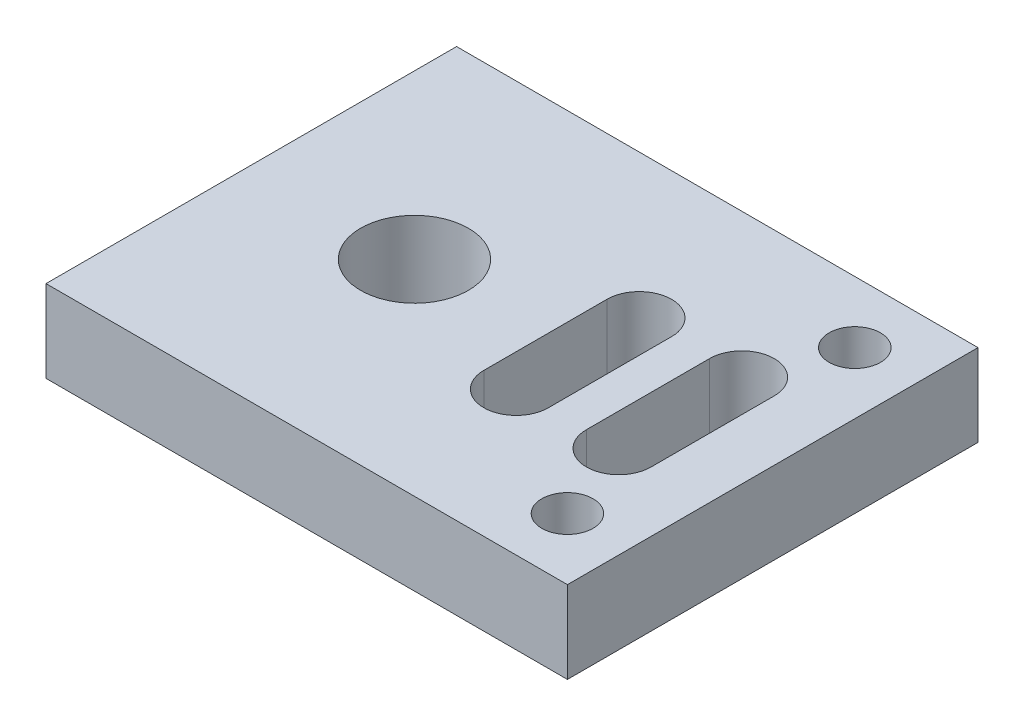
ISO-10303-21;
HEADER;
FILE_DESCRIPTION(('STEP AP214'),'2;1');
FILE_NAME('part.step','',(''),(''),'','','');
FILE_SCHEMA(('AUTOMOTIVE_DESIGN { 1 0 10303 214 1 1 1 1 }'));
ENDSEC;
DATA;
#1=APPLICATION_CONTEXT('core data for automotive mechanical design processes');
#2=APPLICATION_PROTOCOL_DEFINITION('international standard','automotive_design',2000,#1);
#3=PRODUCT_CONTEXT('',#1,'mechanical');
#4=PRODUCT('Part','Part','',(#3));
#5=PRODUCT_RELATED_PRODUCT_CATEGORY('part','',(#4));
#6=PRODUCT_DEFINITION_FORMATION('','',#4);
#7=PRODUCT_DEFINITION_CONTEXT('part definition',#1,'design');
#8=PRODUCT_DEFINITION('design','',#6,#7);
#9=PRODUCT_DEFINITION_SHAPE('','',#8);
#10=(LENGTH_UNIT() NAMED_UNIT(*) SI_UNIT(.MILLI.,.METRE.));
#11=(NAMED_UNIT(*) PLANE_ANGLE_UNIT() SI_UNIT($,.RADIAN.));
#12=(NAMED_UNIT(*) SI_UNIT($,.STERADIAN.) SOLID_ANGLE_UNIT());
#13=UNCERTAINTY_MEASURE_WITH_UNIT(LENGTH_MEASURE(1.E-05),#10,'distance_accuracy_value','');
#14=(GEOMETRIC_REPRESENTATION_CONTEXT(3) GLOBAL_UNCERTAINTY_ASSIGNED_CONTEXT((#13)) GLOBAL_UNIT_ASSIGNED_CONTEXT((#10,
#11,#12)) REPRESENTATION_CONTEXT('',''));
#15=CARTESIAN_POINT('',(0.,0.,0.));
#16=DIRECTION('',(0.,0.,1.));
#17=DIRECTION('',(1.,0.,0.));
#18=AXIS2_PLACEMENT_3D('',#15,#16,#17);
#19=CARTESIAN_POINT('',(0.,-4.,0.));
#20=DIRECTION('',(0.,0.,1.));
#21=DIRECTION('',(1.,0.,0.));
#22=AXIS2_PLACEMENT_3D('',#19,#20,#21);
#23=PLANE('',#22);
#24=DIRECTION('',(1.,0.,0.));
#25=VECTOR('',#24,1.);
#26=CARTESIAN_POINT('',(0.,0.,0.));
#27=LINE('',#26,#25);
#28=CARTESIAN_POINT('',(0.,0.,0.));
#29=VERTEX_POINT('',#28);
#30=CARTESIAN_POINT('',(25.4,0.,0.));
#31=VERTEX_POINT('',#30);
#32=EDGE_CURVE('E204',#29,#31,#27,.T.);
#33=ORIENTED_EDGE('',*,*,#32,.F.);
#34=DIRECTION('',(0.,1.,0.));
#35=VECTOR('',#34,1.);
#36=CARTESIAN_POINT('',(0.,-4.,0.));
#37=LINE('',#36,#35);
#38=CARTESIAN_POINT('',(0.,-4.,0.));
#39=VERTEX_POINT('',#38);
#40=EDGE_CURVE('E11',#39,#29,#37,.T.);
#41=ORIENTED_EDGE('',*,*,#40,.F.);
#42=DIRECTION('',(1.,0.,0.));
#43=VECTOR('',#42,1.);
#44=CARTESIAN_POINT('',(0.,-4.,0.));
#45=LINE('',#44,#43);
#46=CARTESIAN_POINT('',(25.4,-4.,0.));
#47=VERTEX_POINT('',#46);
#48=EDGE_CURVE('E207',#39,#47,#45,.T.);
#49=ORIENTED_EDGE('',*,*,#48,.T.);
#50=DIRECTION('',(0.,1.,0.));
#51=VECTOR('',#50,1.);
#52=CARTESIAN_POINT('',(25.4,-4.,0.));
#53=LINE('',#52,#51);
#54=EDGE_CURVE('E36',#47,#31,#53,.T.);
#55=ORIENTED_EDGE('',*,*,#54,.T.);
#56=EDGE_LOOP('',(#33,#41,#49,#55));
#57=FACE_BOUND('',#56,.T.);
#58=ADVANCED_FACE('F33',(#57),#23,.T.);
#59=CARTESIAN_POINT('',(0.,-4.,-20.));
#60=DIRECTION('',(-1.,0.,0.));
#61=DIRECTION('',(0.,0.,1.));
#62=AXIS2_PLACEMENT_3D('',#59,#60,#61);
#63=PLANE('',#62);
#64=DIRECTION('',(0.,0.,1.));
#65=VECTOR('',#64,1.);
#66=CARTESIAN_POINT('',(0.,0.,-20.));
#67=LINE('',#66,#65);
#68=CARTESIAN_POINT('',(0.,0.,-20.));
#69=VERTEX_POINT('',#68);
#70=EDGE_CURVE('E211',#69,#29,#67,.T.);
#71=ORIENTED_EDGE('',*,*,#70,.F.);
#72=DIRECTION('',(0.,1.,0.));
#73=VECTOR('',#72,1.);
#74=CARTESIAN_POINT('',(0.,-4.,-20.));
#75=LINE('',#74,#73);
#76=CARTESIAN_POINT('',(0.,-4.,-20.));
#77=VERTEX_POINT('',#76);
#78=EDGE_CURVE('E41',#77,#69,#75,.T.);
#79=ORIENTED_EDGE('',*,*,#78,.F.);
#80=DIRECTION('',(0.,0.,1.));
#81=VECTOR('',#80,1.);
#82=CARTESIAN_POINT('',(0.,-4.,-20.));
#83=LINE('',#82,#81);
#84=EDGE_CURVE('E217',#77,#39,#83,.T.);
#85=ORIENTED_EDGE('',*,*,#84,.T.);
#86=ORIENTED_EDGE('',*,*,#40,.T.);
#87=EDGE_LOOP('',(#71,#79,#85,#86));
#88=FACE_BOUND('',#87,.T.);
#89=ADVANCED_FACE('F243',(#88),#63,.T.);
#90=CARTESIAN_POINT('',(25.4,-4.,-20.));
#91=DIRECTION('',(0.,0.,-1.));
#92=DIRECTION('',(-1.,0.,0.));
#93=AXIS2_PLACEMENT_3D('',#90,#91,#92);
#94=PLANE('',#93);
#95=DIRECTION('',(-1.,0.,0.));
#96=VECTOR('',#95,1.);
#97=CARTESIAN_POINT('',(25.4,0.,-20.));
#98=LINE('',#97,#96);
#99=CARTESIAN_POINT('',(25.4,0.,-20.));
#100=VERTEX_POINT('',#99);
#101=EDGE_CURVE('E225',#100,#69,#98,.T.);
#102=ORIENTED_EDGE('',*,*,#101,.F.);
#103=DIRECTION('',(0.,1.,0.));
#104=VECTOR('',#103,1.);
#105=CARTESIAN_POINT('',(25.4,-4.,-20.));
#106=LINE('',#105,#104);
#107=CARTESIAN_POINT('',(25.4,-4.,-20.));
#108=VERTEX_POINT('',#107);
#109=EDGE_CURVE('E230',#108,#100,#106,.T.);
#110=ORIENTED_EDGE('',*,*,#109,.F.);
#111=DIRECTION('',(-1.,0.,0.));
#112=VECTOR('',#111,1.);
#113=CARTESIAN_POINT('',(25.4,-4.,-20.));
#114=LINE('',#113,#112);
#115=EDGE_CURVE('E214',#108,#77,#114,.T.);
#116=ORIENTED_EDGE('',*,*,#115,.T.);
#117=ORIENTED_EDGE('',*,*,#78,.T.);
#118=EDGE_LOOP('',(#102,#110,#116,#117));
#119=FACE_BOUND('',#118,.T.);
#120=ADVANCED_FACE('F248',(#119),#94,.T.);
#121=CARTESIAN_POINT('',(25.4,-4.,0.));
#122=DIRECTION('',(1.,0.,0.));
#123=DIRECTION('',(0.,0.,-1.));
#124=AXIS2_PLACEMENT_3D('',#121,#122,#123);
#125=PLANE('',#124);
#126=DIRECTION('',(0.,0.,-1.));
#127=VECTOR('',#126,1.);
#128=CARTESIAN_POINT('',(25.4,0.,0.));
#129=LINE('',#128,#127);
#130=EDGE_CURVE('E222',#31,#100,#129,.T.);
#131=ORIENTED_EDGE('',*,*,#130,.F.);
#132=ORIENTED_EDGE('',*,*,#54,.F.);
#133=DIRECTION('',(0.,0.,-1.));
#134=VECTOR('',#133,1.);
#135=CARTESIAN_POINT('',(25.4,-4.,0.));
#136=LINE('',#135,#134);
#137=EDGE_CURVE('E210',#47,#108,#136,.T.);
#138=ORIENTED_EDGE('',*,*,#137,.T.);
#139=ORIENTED_EDGE('',*,*,#109,.T.);
#140=EDGE_LOOP('',(#131,#132,#138,#139));
#141=FACE_BOUND('',#140,.T.);
#142=ADVANCED_FACE('F238',(#141),#125,.T.);
#143=CARTESIAN_POINT('',(0.,-4.,0.));
#144=DIRECTION('',(0.,1.,0.));
#145=DIRECTION('',(0.,0.,1.));
#146=AXIS2_PLACEMENT_3D('',#143,#144,#145);
#147=PLANE('',#146);
#148=CARTESIAN_POINT('',(22.4,-4.,-3.));
#149=DIRECTION('',(0.,1.,0.));
#150=DIRECTION('',(0.,0.,-1.));
#151=AXIS2_PLACEMENT_3D('',#148,#149,#150);
#152=CIRCLE('',#151,1.25);
#153=CARTESIAN_POINT('',(22.4,-4.,-4.25));
#154=VERTEX_POINT('',#153);
#155=EDGE_CURVE('E153',#154,#154,#152,.T.);
#156=ORIENTED_EDGE('',*,*,#155,.T.);
#157=EDGE_LOOP('',(#156));
#158=FACE_BOUND('',#157,.T.);
#159=DIRECTION('',(0.,0.,1.));
#160=VECTOR('',#159,1.);
#161=CARTESIAN_POINT('',(14.325,-4.,-7.));
#162=LINE('',#161,#160);
#163=CARTESIAN_POINT('',(14.325,-4.,-13.));
#164=VERTEX_POINT('',#163);
#165=CARTESIAN_POINT('',(14.325,-4.,-7.));
#166=VERTEX_POINT('',#165);
#167=EDGE_CURVE('E130',#164,#166,#162,.T.);
#168=ORIENTED_EDGE('',*,*,#167,.T.);
#169=CARTESIAN_POINT('',(15.9,-4.,-7.));
#170=DIRECTION('',(0.,1.,0.));
#171=DIRECTION('',(0.,0.,1.));
#172=AXIS2_PLACEMENT_3D('',#169,#170,#171);
#173=CIRCLE('',#172,1.575);
#174=CARTESIAN_POINT('',(17.475,-4.,-7.));
#175=VERTEX_POINT('',#174);
#176=EDGE_CURVE('E124',#166,#175,#173,.T.);
#177=ORIENTED_EDGE('',*,*,#176,.T.);
#178=DIRECTION('',(0.,0.,-1.));
#179=VECTOR('',#178,1.);
#180=CARTESIAN_POINT('',(17.475,-4.,-7.));
#181=LINE('',#180,#179);
#182=CARTESIAN_POINT('',(17.475,-4.,-13.));
#183=VERTEX_POINT('',#182);
#184=EDGE_CURVE('E133',#175,#183,#181,.T.);
#185=ORIENTED_EDGE('',*,*,#184,.T.);
#186=CARTESIAN_POINT('',(15.9,-4.,-13.));
#187=DIRECTION('',(0.,1.,0.));
#188=DIRECTION('',(0.,0.,1.));
#189=AXIS2_PLACEMENT_3D('',#186,#187,#188);
#190=CIRCLE('',#189,1.575);
#191=EDGE_CURVE('E49',#183,#164,#190,.T.);
#192=ORIENTED_EDGE('',*,*,#191,.T.);
#193=EDGE_LOOP('',(#168,#177,#185,#192));
#194=FACE_BOUND('',#193,.T.);
#195=CARTESIAN_POINT('',(7.95,-4.,-10.));
#196=DIRECTION('',(0.,1.,0.));
#197=DIRECTION('',(0.,0.,-1.));
#198=AXIS2_PLACEMENT_3D('',#195,#196,#197);
#199=CIRCLE('',#198,2.62499999999999);
#200=CARTESIAN_POINT('',(7.95,-4.,-12.625));
#201=VERTEX_POINT('',#200);
#202=EDGE_CURVE('E163',#201,#201,#199,.T.);
#203=ORIENTED_EDGE('',*,*,#202,.T.);
#204=EDGE_LOOP('',(#203));
#205=FACE_BOUND('',#204,.T.);
#206=DIRECTION('',(0.,0.,1.));
#207=VECTOR('',#206,1.);
#208=CARTESIAN_POINT('',(19.325,-4.,-7.));
#209=LINE('',#208,#207);
#210=CARTESIAN_POINT('',(19.325,-4.,-13.));
#211=VERTEX_POINT('',#210);
#212=CARTESIAN_POINT('',(19.325,-4.,-7.));
#213=VERTEX_POINT('',#212);
#214=EDGE_CURVE('E179',#211,#213,#209,.T.);
#215=ORIENTED_EDGE('',*,*,#214,.T.);
#216=CARTESIAN_POINT('',(20.9,-4.,-7.));
#217=DIRECTION('',(0.,1.,0.));
#218=DIRECTION('',(0.,0.,1.));
#219=AXIS2_PLACEMENT_3D('',#216,#217,#218);
#220=CIRCLE('',#219,1.575);
#221=CARTESIAN_POINT('',(22.475,-4.,-7.));
#222=VERTEX_POINT('',#221);
#223=EDGE_CURVE('E169',#213,#222,#220,.T.);
#224=ORIENTED_EDGE('',*,*,#223,.T.);
#225=DIRECTION('',(0.,0.,-1.));
#226=VECTOR('',#225,1.);
#227=CARTESIAN_POINT('',(22.475,-4.,-7.));
#228=LINE('',#227,#226);
#229=CARTESIAN_POINT('',(22.475,-4.,-13.));
#230=VERTEX_POINT('',#229);
#231=EDGE_CURVE('E172',#222,#230,#228,.T.);
#232=ORIENTED_EDGE('',*,*,#231,.T.);
#233=CARTESIAN_POINT('',(20.9,-4.,-13.));
#234=DIRECTION('',(0.,1.,0.));
#235=DIRECTION('',(0.,0.,1.));
#236=AXIS2_PLACEMENT_3D('',#233,#234,#235);
#237=CIRCLE('',#236,1.575);
#238=EDGE_CURVE('E176',#230,#211,#237,.T.);
#239=ORIENTED_EDGE('',*,*,#238,.T.);
#240=EDGE_LOOP('',(#215,#224,#232,#239));
#241=FACE_BOUND('',#240,.T.);
#242=CARTESIAN_POINT('',(22.4,-4.,-17.));
#243=DIRECTION('',(0.,1.,0.));
#244=DIRECTION('',(0.,0.,-1.));
#245=AXIS2_PLACEMENT_3D('',#242,#243,#244);
#246=CIRCLE('',#245,1.25);
#247=CARTESIAN_POINT('',(22.4,-4.,-18.25));
#248=VERTEX_POINT('',#247);
#249=EDGE_CURVE('E201',#248,#248,#246,.T.);
#250=ORIENTED_EDGE('',*,*,#249,.T.);
#251=EDGE_LOOP('',(#250));
#252=FACE_BOUND('',#251,.T.);
#253=ORIENTED_EDGE('',*,*,#48,.F.);
#254=ORIENTED_EDGE('',*,*,#84,.F.);
#255=ORIENTED_EDGE('',*,*,#115,.F.);
#256=ORIENTED_EDGE('',*,*,#137,.F.);
#257=EDGE_LOOP('',(#253,#254,#255,#256));
#258=FACE_BOUND('',#257,.T.);
#259=ADVANCED_FACE('F137',(#158,#194,#205,#241,#252,#258),#147,.F.);
#260=CARTESIAN_POINT('',(0.,0.,0.));
#261=DIRECTION('',(0.,1.,0.));
#262=DIRECTION('',(0.,0.,1.));
#263=AXIS2_PLACEMENT_3D('',#260,#261,#262);
#264=PLANE('',#263);
#265=CARTESIAN_POINT('',(22.4,0.,-3.));
#266=DIRECTION('',(0.,1.,0.));
#267=DIRECTION('',(0.,0.,-1.));
#268=AXIS2_PLACEMENT_3D('',#265,#266,#267);
#269=CIRCLE('',#268,1.25);
#270=CARTESIAN_POINT('',(22.4,0.,-4.25));
#271=VERTEX_POINT('',#270);
#272=EDGE_CURVE('E146',#271,#271,#269,.T.);
#273=ORIENTED_EDGE('',*,*,#272,.F.);
#274=EDGE_LOOP('',(#273));
#275=FACE_BOUND('',#274,.T.);
#276=CARTESIAN_POINT('',(15.9,0.,-7.));
#277=DIRECTION('',(0.,1.,0.));
#278=DIRECTION('',(0.,0.,1.));
#279=AXIS2_PLACEMENT_3D('',#276,#277,#278);
#280=CIRCLE('',#279,1.575);
#281=CARTESIAN_POINT('',(14.325,0.,-7.));
#282=VERTEX_POINT('',#281);
#283=CARTESIAN_POINT('',(17.475,0.,-7.));
#284=VERTEX_POINT('',#283);
#285=EDGE_CURVE('E57',#282,#284,#280,.T.);
#286=ORIENTED_EDGE('',*,*,#285,.F.);
#287=DIRECTION('',(0.,0.,1.));
#288=VECTOR('',#287,1.);
#289=CARTESIAN_POINT('',(14.325,0.,-7.));
#290=LINE('',#289,#288);
#291=CARTESIAN_POINT('',(14.325,0.,-13.));
#292=VERTEX_POINT('',#291);
#293=EDGE_CURVE('E140',#292,#282,#290,.T.);
#294=ORIENTED_EDGE('',*,*,#293,.F.);
#295=CARTESIAN_POINT('',(15.9,0.,-13.));
#296=DIRECTION('',(0.,1.,0.));
#297=DIRECTION('',(0.,0.,1.));
#298=AXIS2_PLACEMENT_3D('',#295,#296,#297);
#299=CIRCLE('',#298,1.575);
#300=CARTESIAN_POINT('',(17.475,0.,-13.));
#301=VERTEX_POINT('',#300);
#302=EDGE_CURVE('E143',#301,#292,#299,.T.);
#303=ORIENTED_EDGE('',*,*,#302,.F.);
#304=DIRECTION('',(0.,0.,-1.));
#305=VECTOR('',#304,1.);
#306=CARTESIAN_POINT('',(17.475,0.,-7.));
#307=LINE('',#306,#305);
#308=EDGE_CURVE('E152',#284,#301,#307,.T.);
#309=ORIENTED_EDGE('',*,*,#308,.F.);
#310=EDGE_LOOP('',(#286,#294,#303,#309));
#311=FACE_BOUND('',#310,.T.);
#312=CARTESIAN_POINT('',(7.95,0.,-10.));
#313=DIRECTION('',(0.,1.,0.));
#314=DIRECTION('',(0.,0.,-1.));
#315=AXIS2_PLACEMENT_3D('',#312,#313,#314);
#316=CIRCLE('',#315,2.62499999999999);
#317=CARTESIAN_POINT('',(7.95,0.,-12.625));
#318=VERTEX_POINT('',#317);
#319=EDGE_CURVE('E159',#318,#318,#316,.T.);
#320=ORIENTED_EDGE('',*,*,#319,.F.);
#321=EDGE_LOOP('',(#320));
#322=FACE_BOUND('',#321,.T.);
#323=CARTESIAN_POINT('',(20.9,0.,-7.));
#324=DIRECTION('',(0.,1.,0.));
#325=DIRECTION('',(0.,0.,1.));
#326=AXIS2_PLACEMENT_3D('',#323,#324,#325);
#327=CIRCLE('',#326,1.575);
#328=CARTESIAN_POINT('',(19.325,0.,-7.));
#329=VERTEX_POINT('',#328);
#330=CARTESIAN_POINT('',(22.475,0.,-7.));
#331=VERTEX_POINT('',#330);
#332=EDGE_CURVE('E166',#329,#331,#327,.T.);
#333=ORIENTED_EDGE('',*,*,#332,.F.);
#334=DIRECTION('',(0.,0.,1.));
#335=VECTOR('',#334,1.);
#336=CARTESIAN_POINT('',(19.325,0.,-7.));
#337=LINE('',#336,#335);
#338=CARTESIAN_POINT('',(19.325,0.,-13.));
#339=VERTEX_POINT('',#338);
#340=EDGE_CURVE('E173',#339,#329,#337,.T.);
#341=ORIENTED_EDGE('',*,*,#340,.F.);
#342=CARTESIAN_POINT('',(20.9,0.,-13.));
#343=DIRECTION('',(0.,1.,0.));
#344=DIRECTION('',(0.,0.,1.));
#345=AXIS2_PLACEMENT_3D('',#342,#343,#344);
#346=CIRCLE('',#345,1.575);
#347=CARTESIAN_POINT('',(22.475,0.,-13.));
#348=VERTEX_POINT('',#347);
#349=EDGE_CURVE('E187',#348,#339,#346,.T.);
#350=ORIENTED_EDGE('',*,*,#349,.F.);
#351=DIRECTION('',(0.,0.,-1.));
#352=VECTOR('',#351,1.);
#353=CARTESIAN_POINT('',(22.475,0.,-7.));
#354=LINE('',#353,#352);
#355=EDGE_CURVE('E184',#331,#348,#354,.T.);
#356=ORIENTED_EDGE('',*,*,#355,.F.);
#357=EDGE_LOOP('',(#333,#341,#350,#356));
#358=FACE_BOUND('',#357,.T.);
#359=CARTESIAN_POINT('',(22.4,0.,-17.));
#360=DIRECTION('',(0.,1.,0.));
#361=DIRECTION('',(0.,0.,-1.));
#362=AXIS2_PLACEMENT_3D('',#359,#360,#361);
#363=CIRCLE('',#362,1.25);
#364=CARTESIAN_POINT('',(22.4,0.,-18.25));
#365=VERTEX_POINT('',#364);
#366=EDGE_CURVE('E194',#365,#365,#363,.T.);
#367=ORIENTED_EDGE('',*,*,#366,.F.);
#368=EDGE_LOOP('',(#367));
#369=FACE_BOUND('',#368,.T.);
#370=ORIENTED_EDGE('',*,*,#32,.T.);
#371=ORIENTED_EDGE('',*,*,#130,.T.);
#372=ORIENTED_EDGE('',*,*,#101,.T.);
#373=ORIENTED_EDGE('',*,*,#70,.T.);
#374=EDGE_LOOP('',(#370,#371,#372,#373));
#375=FACE_BOUND('',#374,.T.);
#376=ADVANCED_FACE('F240',(#275,#311,#322,#358,#369,#375),#264,.T.);
#377=CARTESIAN_POINT('',(22.4,-4.,-17.));
#378=DIRECTION('',(0.,1.,0.));
#379=DIRECTION('',(0.,0.,1.));
#380=AXIS2_PLACEMENT_3D('',#377,#378,#379);
#381=CYLINDRICAL_SURFACE('',#380,1.25);
#382=ORIENTED_EDGE('',*,*,#249,.F.);
#383=EDGE_LOOP('',(#382));
#384=FACE_BOUND('',#383,.T.);
#385=ORIENTED_EDGE('',*,*,#366,.T.);
#386=EDGE_LOOP('',(#385));
#387=FACE_BOUND('',#386,.T.);
#388=ADVANCED_FACE('F291',(#384,#387),#381,.F.);
#389=CARTESIAN_POINT('',(20.9,-4.,-7.));
#390=DIRECTION('',(0.,1.,0.));
#391=DIRECTION('',(0.,0.,1.));
#392=AXIS2_PLACEMENT_3D('',#389,#390,#391);
#393=CYLINDRICAL_SURFACE('',#392,1.575);
#394=ORIENTED_EDGE('',*,*,#332,.T.);
#395=DIRECTION('',(0.,1.,0.));
#396=VECTOR('',#395,1.);
#397=CARTESIAN_POINT('',(22.475,-4.,-7.));
#398=LINE('',#397,#396);
#399=EDGE_CURVE('E182',#222,#331,#398,.T.);
#400=ORIENTED_EDGE('',*,*,#399,.F.);
#401=ORIENTED_EDGE('',*,*,#223,.F.);
#402=DIRECTION('',(0.,1.,0.));
#403=VECTOR('',#402,1.);
#404=CARTESIAN_POINT('',(19.325,-4.,-7.));
#405=LINE('',#404,#403);
#406=EDGE_CURVE('E192',#213,#329,#405,.T.);
#407=ORIENTED_EDGE('',*,*,#406,.T.);
#408=EDGE_LOOP('',(#394,#400,#401,#407));
#409=FACE_BOUND('',#408,.T.);
#410=ADVANCED_FACE('F301',(#409),#393,.F.);
#411=CARTESIAN_POINT('',(19.325,-4.,-7.));
#412=DIRECTION('',(-1.,0.,0.));
#413=DIRECTION('',(0.,0.,1.));
#414=AXIS2_PLACEMENT_3D('',#411,#412,#413);
#415=PLANE('',#414);
#416=ORIENTED_EDGE('',*,*,#340,.T.);
#417=ORIENTED_EDGE('',*,*,#406,.F.);
#418=ORIENTED_EDGE('',*,*,#214,.F.);
#419=DIRECTION('',(0.,1.,0.));
#420=VECTOR('',#419,1.);
#421=CARTESIAN_POINT('',(19.325,-4.,-13.));
#422=LINE('',#421,#420);
#423=EDGE_CURVE('E195',#211,#339,#422,.T.);
#424=ORIENTED_EDGE('',*,*,#423,.T.);
#425=EDGE_LOOP('',(#416,#417,#418,#424));
#426=FACE_BOUND('',#425,.T.);
#427=ADVANCED_FACE('F311',(#426),#415,.F.);
#428=CARTESIAN_POINT('',(20.9,-4.,-13.));
#429=DIRECTION('',(0.,1.,0.));
#430=DIRECTION('',(0.,0.,1.));
#431=AXIS2_PLACEMENT_3D('',#428,#429,#430);
#432=CYLINDRICAL_SURFACE('',#431,1.575);
#433=ORIENTED_EDGE('',*,*,#349,.T.);
#434=ORIENTED_EDGE('',*,*,#423,.F.);
#435=ORIENTED_EDGE('',*,*,#238,.F.);
#436=DIRECTION('',(0.,1.,0.));
#437=VECTOR('',#436,1.);
#438=CARTESIAN_POINT('',(22.475,-4.,-13.));
#439=LINE('',#438,#437);
#440=EDGE_CURVE('E197',#230,#348,#439,.T.);
#441=ORIENTED_EDGE('',*,*,#440,.T.);
#442=EDGE_LOOP('',(#433,#434,#435,#441));
#443=FACE_BOUND('',#442,.T.);
#444=ADVANCED_FACE('F321',(#443),#432,.F.);
#445=CARTESIAN_POINT('',(22.475,-4.,-7.));
#446=DIRECTION('',(1.,0.,0.));
#447=DIRECTION('',(0.,0.,-1.));
#448=AXIS2_PLACEMENT_3D('',#445,#446,#447);
#449=PLANE('',#448);
#450=ORIENTED_EDGE('',*,*,#355,.T.);
#451=ORIENTED_EDGE('',*,*,#440,.F.);
#452=ORIENTED_EDGE('',*,*,#231,.F.);
#453=ORIENTED_EDGE('',*,*,#399,.T.);
#454=EDGE_LOOP('',(#450,#451,#452,#453));
#455=FACE_BOUND('',#454,.T.);
#456=ADVANCED_FACE('F331',(#455),#449,.F.);
#457=CARTESIAN_POINT('',(7.95,-4.,-10.));
#458=DIRECTION('',(0.,1.,0.));
#459=DIRECTION('',(0.,0.,1.));
#460=AXIS2_PLACEMENT_3D('',#457,#458,#459);
#461=CYLINDRICAL_SURFACE('',#460,2.62499999999999);
#462=ORIENTED_EDGE('',*,*,#202,.F.);
#463=EDGE_LOOP('',(#462));
#464=FACE_BOUND('',#463,.T.);
#465=ORIENTED_EDGE('',*,*,#319,.T.);
#466=EDGE_LOOP('',(#465));
#467=FACE_BOUND('',#466,.T.);
#468=ADVANCED_FACE('F341',(#464,#467),#461,.F.);
#469=CARTESIAN_POINT('',(15.9,-4.,-7.));
#470=DIRECTION('',(0.,1.,0.));
#471=DIRECTION('',(0.,0.,1.));
#472=AXIS2_PLACEMENT_3D('',#469,#470,#471);
#473=CYLINDRICAL_SURFACE('',#472,1.575);
#474=ORIENTED_EDGE('',*,*,#285,.T.);
#475=DIRECTION('',(0.,1.,0.));
#476=VECTOR('',#475,1.);
#477=CARTESIAN_POINT('',(17.475,-4.,-7.));
#478=LINE('',#477,#476);
#479=EDGE_CURVE('E120',#175,#284,#478,.T.);
#480=ORIENTED_EDGE('',*,*,#479,.F.);
#481=ORIENTED_EDGE('',*,*,#176,.F.);
#482=DIRECTION('',(0.,1.,0.));
#483=VECTOR('',#482,1.);
#484=CARTESIAN_POINT('',(14.325,-4.,-7.));
#485=LINE('',#484,#483);
#486=EDGE_CURVE('E157',#166,#282,#485,.T.);
#487=ORIENTED_EDGE('',*,*,#486,.T.);
#488=EDGE_LOOP('',(#474,#480,#481,#487));
#489=FACE_BOUND('',#488,.T.);
#490=ADVANCED_FACE('F122',(#489),#473,.F.);
#491=CARTESIAN_POINT('',(14.325,-4.,-7.));
#492=DIRECTION('',(-1.,0.,0.));
#493=DIRECTION('',(0.,0.,1.));
#494=AXIS2_PLACEMENT_3D('',#491,#492,#493);
#495=PLANE('',#494);
#496=ORIENTED_EDGE('',*,*,#293,.T.);
#497=ORIENTED_EDGE('',*,*,#486,.F.);
#498=ORIENTED_EDGE('',*,*,#167,.F.);
#499=DIRECTION('',(0.,1.,0.));
#500=VECTOR('',#499,1.);
#501=CARTESIAN_POINT('',(14.325,-4.,-13.));
#502=LINE('',#501,#500);
#503=EDGE_CURVE('E160',#164,#292,#502,.T.);
#504=ORIENTED_EDGE('',*,*,#503,.T.);
#505=EDGE_LOOP('',(#496,#497,#498,#504));
#506=FACE_BOUND('',#505,.T.);
#507=ADVANCED_FACE('F360',(#506),#495,.F.);
#508=CARTESIAN_POINT('',(15.9,-4.,-13.));
#509=DIRECTION('',(0.,1.,0.));
#510=DIRECTION('',(0.,0.,1.));
#511=AXIS2_PLACEMENT_3D('',#508,#509,#510);
#512=CYLINDRICAL_SURFACE('',#511,1.575);
#513=ORIENTED_EDGE('',*,*,#302,.T.);
#514=ORIENTED_EDGE('',*,*,#503,.F.);
#515=ORIENTED_EDGE('',*,*,#191,.F.);
#516=DIRECTION('',(0.,1.,0.));
#517=VECTOR('',#516,1.);
#518=CARTESIAN_POINT('',(17.475,-4.,-13.));
#519=LINE('',#518,#517);
#520=EDGE_CURVE('E129',#183,#301,#519,.T.);
#521=ORIENTED_EDGE('',*,*,#520,.T.);
#522=EDGE_LOOP('',(#513,#514,#515,#521));
#523=FACE_BOUND('',#522,.T.);
#524=ADVANCED_FACE('F369',(#523),#512,.F.);
#525=CARTESIAN_POINT('',(17.475,-4.,-7.));
#526=DIRECTION('',(1.,0.,0.));
#527=DIRECTION('',(0.,0.,-1.));
#528=AXIS2_PLACEMENT_3D('',#525,#526,#527);
#529=PLANE('',#528);
#530=ORIENTED_EDGE('',*,*,#308,.T.);
#531=ORIENTED_EDGE('',*,*,#520,.F.);
#532=ORIENTED_EDGE('',*,*,#184,.F.);
#533=ORIENTED_EDGE('',*,*,#479,.T.);
#534=EDGE_LOOP('',(#530,#531,#532,#533));
#535=FACE_BOUND('',#534,.T.);
#536=ADVANCED_FACE('F134',(#535),#529,.F.);
#537=CARTESIAN_POINT('',(22.4,-4.,-3.));
#538=DIRECTION('',(0.,1.,0.));
#539=DIRECTION('',(0.,0.,1.));
#540=AXIS2_PLACEMENT_3D('',#537,#538,#539);
#541=CYLINDRICAL_SURFACE('',#540,1.25);
#542=ORIENTED_EDGE('',*,*,#155,.F.);
#543=EDGE_LOOP('',(#542));
#544=FACE_BOUND('',#543,.T.);
#545=ORIENTED_EDGE('',*,*,#272,.T.);
#546=EDGE_LOOP('',(#545));
#547=FACE_BOUND('',#546,.T.);
#548=ADVANCED_FACE('F387',(#544,#547),#541,.F.);
#549=CLOSED_SHELL('',(#58,#89,#120,#142,#259,#376,#388,#410,#427,#444,#456,#468,#490,#507,#524,
#536,#548));
#550=MANIFOLD_SOLID_BREP('B2',#549);
#551=ADVANCED_BREP_SHAPE_REPRESENTATION('',(#18,#550),#14);
#552=SHAPE_DEFINITION_REPRESENTATION(#9,#551);
ENDSEC;
END-ISO-10303-21;
